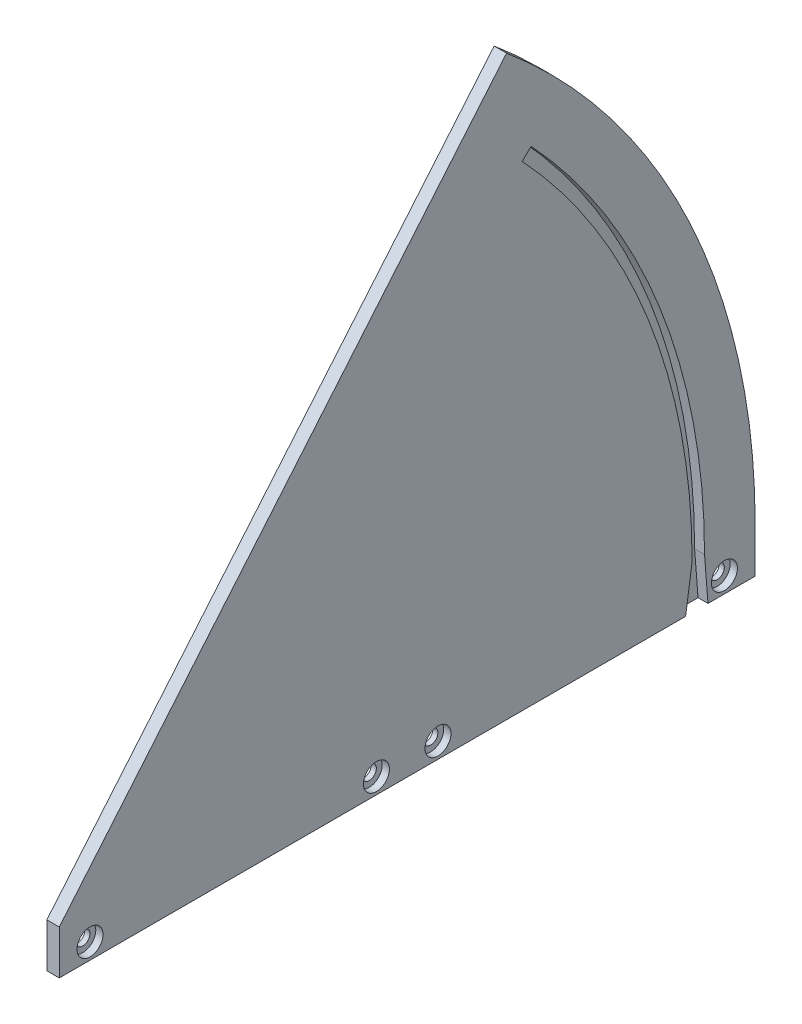
ISO-10303-21;
HEADER;
FILE_DESCRIPTION(('STEP AP214'),'2;1');
FILE_NAME('part.step','',(''),(''),'','','');
FILE_SCHEMA(('AUTOMOTIVE_DESIGN { 1 0 10303 214 1 1 1 1 }'));
ENDSEC;
DATA;
#1=APPLICATION_CONTEXT('core data for automotive mechanical design processes');
#2=APPLICATION_PROTOCOL_DEFINITION('international standard','automotive_design',2000,#1);
#3=PRODUCT_CONTEXT('',#1,'mechanical');
#4=PRODUCT('Part','Part','',(#3));
#5=PRODUCT_RELATED_PRODUCT_CATEGORY('part','',(#4));
#6=PRODUCT_DEFINITION_FORMATION('','',#4);
#7=PRODUCT_DEFINITION_CONTEXT('part definition',#1,'design');
#8=PRODUCT_DEFINITION('design','',#6,#7);
#9=PRODUCT_DEFINITION_SHAPE('','',#8);
#10=(LENGTH_UNIT() NAMED_UNIT(*) SI_UNIT(.MILLI.,.METRE.));
#11=(NAMED_UNIT(*) PLANE_ANGLE_UNIT() SI_UNIT($,.RADIAN.));
#12=(NAMED_UNIT(*) SI_UNIT($,.STERADIAN.) SOLID_ANGLE_UNIT());
#13=UNCERTAINTY_MEASURE_WITH_UNIT(LENGTH_MEASURE(1.E-05),#10,'distance_accuracy_value','');
#14=(GEOMETRIC_REPRESENTATION_CONTEXT(3) GLOBAL_UNCERTAINTY_ASSIGNED_CONTEXT((#13)) GLOBAL_UNIT_ASSIGNED_CONTEXT((#10,
#11,#12)) REPRESENTATION_CONTEXT('',''));
#15=CARTESIAN_POINT('',(0.,0.,0.));
#16=DIRECTION('',(0.,0.,1.));
#17=DIRECTION('',(1.,0.,0.));
#18=AXIS2_PLACEMENT_3D('',#15,#16,#17);
#19=CARTESIAN_POINT('',(0.,-7.239,-170.18));
#20=DIRECTION('',(1.,0.,0.));
#21=DIRECTION('',(0.,0.,-1.));
#22=AXIS2_PLACEMENT_3D('',#19,#20,#21);
#23=CYLINDRICAL_SURFACE('',#22,1.82880000000001);
#24=CARTESIAN_POINT('',(0.,-7.239,-170.18));
#25=DIRECTION('',(1.,0.,0.));
#26=DIRECTION('',(0.,0.,1.));
#27=AXIS2_PLACEMENT_3D('',#24,#25,#26);
#28=CIRCLE('',#27,1.82880000000001);
#29=CARTESIAN_POINT('',(0.,-7.239,-168.3512));
#30=VERTEX_POINT('',#29);
#31=EDGE_CURVE('E147',#30,#30,#28,.T.);
#32=ORIENTED_EDGE('',*,*,#31,.F.);
#33=EDGE_LOOP('',(#32));
#34=FACE_BOUND('',#33,.T.);
#35=CARTESIAN_POINT('',(1.3208,-7.239,-170.18));
#36=DIRECTION('',(1.,0.,0.));
#37=DIRECTION('',(0.,0.,-1.));
#38=AXIS2_PLACEMENT_3D('',#35,#36,#37);
#39=CIRCLE('',#38,1.82880000000001);
#40=CARTESIAN_POINT('',(1.3208,-7.239,-172.0088));
#41=VERTEX_POINT('',#40);
#42=EDGE_CURVE('E37',#41,#41,#39,.F.);
#43=ORIENTED_EDGE('',*,*,#42,.F.);
#44=EDGE_LOOP('',(#43));
#45=FACE_BOUND('',#44,.T.);
#46=ADVANCED_FACE('F33',(#34,#45),#23,.F.);
#47=CARTESIAN_POINT('',(0.,-7.23899999999998,-96.901));
#48=DIRECTION('',(1.,0.,0.));
#49=DIRECTION('',(0.,0.,-1.));
#50=AXIS2_PLACEMENT_3D('',#47,#48,#49);
#51=CYLINDRICAL_SURFACE('',#50,1.8288);
#52=CARTESIAN_POINT('',(0.,-7.23899999999998,-96.901));
#53=DIRECTION('',(1.,0.,0.));
#54=DIRECTION('',(0.,0.,1.));
#55=AXIS2_PLACEMENT_3D('',#52,#53,#54);
#56=CIRCLE('',#55,1.8288);
#57=CARTESIAN_POINT('',(0.,-7.23899999999998,-95.0722));
#58=VERTEX_POINT('',#57);
#59=EDGE_CURVE('E151',#58,#58,#56,.T.);
#60=ORIENTED_EDGE('',*,*,#59,.F.);
#61=EDGE_LOOP('',(#60));
#62=FACE_BOUND('',#61,.T.);
#63=CARTESIAN_POINT('',(1.3208,-7.23899999999998,-96.901));
#64=DIRECTION('',(1.,0.,0.));
#65=DIRECTION('',(0.,0.,-1.));
#66=AXIS2_PLACEMENT_3D('',#63,#64,#65);
#67=CIRCLE('',#66,1.8288);
#68=CARTESIAN_POINT('',(1.3208,-7.23899999999998,-98.7298));
#69=VERTEX_POINT('',#68);
#70=EDGE_CURVE('E204',#69,#69,#67,.F.);
#71=ORIENTED_EDGE('',*,*,#70,.F.);
#72=EDGE_LOOP('',(#71));
#73=FACE_BOUND('',#72,.T.);
#74=ADVANCED_FACE('F292',(#62,#73),#51,.F.);
#75=CARTESIAN_POINT('',(0.,-7.23899999999998,-81.153));
#76=DIRECTION('',(1.,0.,0.));
#77=DIRECTION('',(0.,0.,-1.));
#78=AXIS2_PLACEMENT_3D('',#75,#76,#77);
#79=CYLINDRICAL_SURFACE('',#78,1.8288);
#80=CARTESIAN_POINT('',(0.,-7.23899999999998,-81.153));
#81=DIRECTION('',(1.,0.,0.));
#82=DIRECTION('',(0.,0.,-1.));
#83=AXIS2_PLACEMENT_3D('',#80,#81,#82);
#84=CIRCLE('',#83,1.8288);
#85=CARTESIAN_POINT('',(0.,-7.23899999999998,-82.9818));
#86=VERTEX_POINT('',#85);
#87=EDGE_CURVE('E159',#86,#86,#84,.T.);
#88=ORIENTED_EDGE('',*,*,#87,.F.);
#89=EDGE_LOOP('',(#88));
#90=FACE_BOUND('',#89,.T.);
#91=CARTESIAN_POINT('',(1.3208,-7.23899999999998,-81.153));
#92=DIRECTION('',(1.,0.,0.));
#93=DIRECTION('',(0.,0.,-1.));
#94=AXIS2_PLACEMENT_3D('',#91,#92,#93);
#95=CIRCLE('',#94,1.8288);
#96=CARTESIAN_POINT('',(1.3208,-7.23899999999998,-82.9818));
#97=VERTEX_POINT('',#96);
#98=EDGE_CURVE('E200',#97,#97,#95,.F.);
#99=ORIENTED_EDGE('',*,*,#98,.F.);
#100=EDGE_LOOP('',(#99));
#101=FACE_BOUND('',#100,.T.);
#102=ADVANCED_FACE('F298',(#90,#101),#79,.F.);
#103=CARTESIAN_POINT('',(0.,-7.239,-7.874));
#104=DIRECTION('',(1.,0.,0.));
#105=DIRECTION('',(0.,0.,-1.));
#106=AXIS2_PLACEMENT_3D('',#103,#104,#105);
#107=CYLINDRICAL_SURFACE('',#106,1.8288);
#108=CARTESIAN_POINT('',(0.,-7.239,-7.874));
#109=DIRECTION('',(1.,0.,0.));
#110=DIRECTION('',(0.,0.,-1.));
#111=AXIS2_PLACEMENT_3D('',#108,#109,#110);
#112=CIRCLE('',#111,1.8288);
#113=CARTESIAN_POINT('',(0.,-7.239,-9.7028));
#114=VERTEX_POINT('',#113);
#115=EDGE_CURVE('E162',#114,#114,#112,.T.);
#116=ORIENTED_EDGE('',*,*,#115,.F.);
#117=EDGE_LOOP('',(#116));
#118=FACE_BOUND('',#117,.T.);
#119=CARTESIAN_POINT('',(1.3208,-7.239,-7.874));
#120=DIRECTION('',(1.,0.,0.));
#121=DIRECTION('',(0.,0.,-1.));
#122=AXIS2_PLACEMENT_3D('',#119,#120,#121);
#123=CIRCLE('',#122,1.8288);
#124=CARTESIAN_POINT('',(1.3208,-7.239,-9.7028));
#125=VERTEX_POINT('',#124);
#126=EDGE_CURVE('E195',#125,#125,#123,.F.);
#127=ORIENTED_EDGE('',*,*,#126,.F.);
#128=EDGE_LOOP('',(#127));
#129=FACE_BOUND('',#128,.T.);
#130=ADVANCED_FACE('F307',(#118,#129),#107,.F.);
#131=CARTESIAN_POINT('',(3.175,0.,0.));
#132=DIRECTION('',(1.,0.,0.));
#133=DIRECTION('',(0.,0.,-1.));
#134=AXIS2_PLACEMENT_3D('',#131,#132,#133);
#135=PLANE('',#134);
#136=CARTESIAN_POINT('',(3.175,-7.239,-170.18));
#137=DIRECTION('',(1.,0.,0.));
#138=DIRECTION('',(0.,0.,-1.));
#139=AXIS2_PLACEMENT_3D('',#136,#137,#138);
#140=CIRCLE('',#139,3.32740000000002);
#141=CARTESIAN_POINT('',(3.175,-7.239,-173.5074));
#142=VERTEX_POINT('',#141);
#143=EDGE_CURVE('E220',#142,#142,#140,.T.);
#144=ORIENTED_EDGE('',*,*,#143,.F.);
#145=EDGE_LOOP('',(#144));
#146=FACE_BOUND('',#145,.T.);
#147=CARTESIAN_POINT('',(3.175,-7.23899999999998,-96.901));
#148=DIRECTION('',(1.,0.,0.));
#149=DIRECTION('',(0.,0.,-1.));
#150=AXIS2_PLACEMENT_3D('',#147,#148,#149);
#151=CIRCLE('',#150,3.3274);
#152=CARTESIAN_POINT('',(3.175,-7.23899999999998,-100.2284));
#153=VERTEX_POINT('',#152);
#154=EDGE_CURVE('E213',#153,#153,#151,.T.);
#155=ORIENTED_EDGE('',*,*,#154,.F.);
#156=EDGE_LOOP('',(#155));
#157=FACE_BOUND('',#156,.T.);
#158=CARTESIAN_POINT('',(3.175,-7.23899999999998,-81.153));
#159=DIRECTION('',(1.,0.,0.));
#160=DIRECTION('',(0.,0.,-1.));
#161=AXIS2_PLACEMENT_3D('',#158,#159,#160);
#162=CIRCLE('',#161,3.3274);
#163=CARTESIAN_POINT('',(3.175,-7.23899999999998,-84.4804));
#164=VERTEX_POINT('',#163);
#165=EDGE_CURVE('E206',#164,#164,#162,.T.);
#166=ORIENTED_EDGE('',*,*,#165,.F.);
#167=EDGE_LOOP('',(#166));
#168=FACE_BOUND('',#167,.T.);
#169=CARTESIAN_POINT('',(3.175,-7.239,-7.874));
#170=DIRECTION('',(1.,0.,0.));
#171=DIRECTION('',(0.,0.,-1.));
#172=AXIS2_PLACEMENT_3D('',#169,#170,#171);
#173=CIRCLE('',#172,3.3274);
#174=CARTESIAN_POINT('',(3.175,-7.239,-11.2014));
#175=VERTEX_POINT('',#174);
#176=EDGE_CURVE('E202',#175,#175,#173,.T.);
#177=ORIENTED_EDGE('',*,*,#176,.F.);
#178=EDGE_LOOP('',(#177));
#179=FACE_BOUND('',#178,.T.);
#180=DIRECTION('',(0.,0.,1.));
#181=VECTOR('',#180,1.);
#182=CARTESIAN_POINT('',(3.175,-11.303,-178.054));
#183=LINE('',#182,#181);
#184=CARTESIAN_POINT('',(3.175,-11.303,-160.260021407787));
#185=VERTEX_POINT('',#184);
#186=CARTESIAN_POINT('',(3.175,-11.303,0.));
#187=VERTEX_POINT('',#186);
#188=EDGE_CURVE('E170',#185,#187,#183,.T.);
#189=ORIENTED_EDGE('',*,*,#188,.F.);
#190=DIRECTION('',(0.,0.989324172843865,-0.145731537516086));
#191=VECTOR('',#190,1.);
#192=CARTESIAN_POINT('',(3.175,-11.303,-160.260021407787));
#193=LINE('',#192,#191);
#194=CARTESIAN_POINT('',(3.175,0.,-161.925));
#195=VERTEX_POINT('',#194);
#196=EDGE_CURVE('E198',#185,#195,#193,.T.);
#197=ORIENTED_EDGE('',*,*,#196,.T.);
#198=CARTESIAN_POINT('',(3.175,0.,0.));
#199=DIRECTION('',(1.,0.,0.));
#200=DIRECTION('',(0.,0.,-1.));
#201=AXIS2_PLACEMENT_3D('',#198,#199,#200);
#202=CIRCLE('',#201,161.925);
#203=CARTESIAN_POINT('',(3.175,110.43258445312,-118.424448134684));
#204=VERTEX_POINT('',#203);
#205=EDGE_CURVE('E146',#195,#204,#202,.T.);
#206=ORIENTED_EDGE('',*,*,#205,.T.);
#207=DIRECTION('',(0.,-0.681998360062499,0.73135370161917));
#208=VECTOR('',#207,1.);
#209=CARTESIAN_POINT('',(3.175,112.597929246319,-120.746496137325));
#210=LINE('',#209,#208);
#211=CARTESIAN_POINT('',(3.175,112.597929246319,-120.746496137325));
#212=VERTEX_POINT('',#211);
#213=EDGE_CURVE('E238',#212,#204,#210,.T.);
#214=ORIENTED_EDGE('',*,*,#213,.F.);
#215=CARTESIAN_POINT('',(3.175,0.,0.));
#216=DIRECTION('',(1.,0.,0.));
#217=DIRECTION('',(0.,0.,-1.));
#218=AXIS2_PLACEMENT_3D('',#215,#216,#217);
#219=CIRCLE('',#218,165.1);
#220=CARTESIAN_POINT('',(3.175,0.,-165.1));
#221=VERTEX_POINT('',#220);
#222=EDGE_CURVE('E241',#221,#212,#219,.T.);
#223=ORIENTED_EDGE('',*,*,#222,.F.);
#224=DIRECTION('',(0.,-0.996964960372701,-0.077851575379422));
#225=VECTOR('',#224,1.);
#226=CARTESIAN_POINT('',(3.175,0.,-165.1));
#227=LINE('',#226,#225);
#228=CARTESIAN_POINT('',(3.175,-11.303,-165.98263518929));
#229=VERTEX_POINT('',#228);
#230=EDGE_CURVE('E142',#221,#229,#227,.T.);
#231=ORIENTED_EDGE('',*,*,#230,.T.);
#232=CARTESIAN_POINT('',(3.175,-11.303,-178.054));
#233=VERTEX_POINT('',#232);
#234=EDGE_CURVE('E171',#233,#229,#183,.T.);
#235=ORIENTED_EDGE('',*,*,#234,.F.);
#236=DIRECTION('',(0.,1.,0.));
#237=VECTOR('',#236,1.);
#238=CARTESIAN_POINT('',(3.175,-11.303,-178.054));
#239=LINE('',#238,#237);
#240=CARTESIAN_POINT('',(3.175,0.,-178.054));
#241=VERTEX_POINT('',#240);
#242=EDGE_CURVE('E182',#233,#241,#239,.T.);
#243=ORIENTED_EDGE('',*,*,#242,.T.);
#244=CARTESIAN_POINT('',(3.175,0.,0.));
#245=DIRECTION('',(1.,0.,0.));
#246=DIRECTION('',(0.,0.,-1.));
#247=AXIS2_PLACEMENT_3D('',#244,#245,#246);
#248=CIRCLE('',#247,178.054);
#249=CARTESIAN_POINT('',(3.175,136.397277275107,-114.450905055127));
#250=VERTEX_POINT('',#249);
#251=EDGE_CURVE('E59',#241,#250,#248,.T.);
#252=ORIENTED_EDGE('',*,*,#251,.T.);
#253=DIRECTION('',(0.,-0.766044443118979,0.642787609686538));
#254=VECTOR('',#253,1.);
#255=CARTESIAN_POINT('',(3.175,0.,0.));
#256=LINE('',#255,#254);
#257=CARTESIAN_POINT('',(3.175,0.,0.));
#258=VERTEX_POINT('',#257);
#259=EDGE_CURVE('E76',#250,#258,#256,.T.);
#260=ORIENTED_EDGE('',*,*,#259,.T.);
#261=DIRECTION('',(0.,1.,0.));
#262=VECTOR('',#261,1.);
#263=CARTESIAN_POINT('',(3.175,-11.303,0.));
#264=LINE('',#263,#262);
#265=EDGE_CURVE('E179',#187,#258,#264,.T.);
#266=ORIENTED_EDGE('',*,*,#265,.F.);
#267=EDGE_LOOP('',(#189,#197,#206,#214,#223,#231,#235,#243,#252,#260,#266));
#268=FACE_BOUND('',#267,.T.);
#269=ADVANCED_FACE('F259',(#146,#157,#168,#179,#268),#135,.T.);
#270=CARTESIAN_POINT('',(0.,-11.303,0.));
#271=DIRECTION('',(0.,1.,0.));
#272=DIRECTION('',(0.,0.,1.));
#273=AXIS2_PLACEMENT_3D('',#270,#271,#272);
#274=PLANE('',#273);
#275=DIRECTION('',(1.,0.,0.));
#276=VECTOR('',#275,1.);
#277=CARTESIAN_POINT('',(0.635,-11.303,-160.260021407787));
#278=LINE('',#277,#276);
#279=CARTESIAN_POINT('',(0.635,-11.303,-160.260021407787));
#280=VERTEX_POINT('',#279);
#281=EDGE_CURVE('E140',#280,#185,#278,.T.);
#282=ORIENTED_EDGE('',*,*,#281,.T.);
#283=ORIENTED_EDGE('',*,*,#188,.T.);
#284=DIRECTION('',(-1.,0.,0.));
#285=VECTOR('',#284,1.);
#286=CARTESIAN_POINT('',(0.,-11.303,0.));
#287=LINE('',#286,#285);
#288=CARTESIAN_POINT('',(0.,-11.303,0.));
#289=VERTEX_POINT('',#288);
#290=EDGE_CURVE('E174',#187,#289,#287,.T.);
#291=ORIENTED_EDGE('',*,*,#290,.T.);
#292=DIRECTION('',(0.,0.,-1.));
#293=VECTOR('',#292,1.);
#294=CARTESIAN_POINT('',(0.,-11.303,-178.054));
#295=LINE('',#294,#293);
#296=CARTESIAN_POINT('',(0.,-11.303,-178.054));
#297=VERTEX_POINT('',#296);
#298=EDGE_CURVE('E165',#289,#297,#295,.T.);
#299=ORIENTED_EDGE('',*,*,#298,.T.);
#300=DIRECTION('',(1.,0.,0.));
#301=VECTOR('',#300,1.);
#302=CARTESIAN_POINT('',(0.,-11.303,-178.054));
#303=LINE('',#302,#301);
#304=EDGE_CURVE('E168',#297,#233,#303,.T.);
#305=ORIENTED_EDGE('',*,*,#304,.T.);
#306=ORIENTED_EDGE('',*,*,#234,.T.);
#307=DIRECTION('',(1.,0.,0.));
#308=VECTOR('',#307,1.);
#309=CARTESIAN_POINT('',(0.635,-11.303,-165.98263518929));
#310=LINE('',#309,#308);
#311=CARTESIAN_POINT('',(0.635,-11.303,-165.98263518929));
#312=VERTEX_POINT('',#311);
#313=EDGE_CURVE('E247',#312,#229,#310,.T.);
#314=ORIENTED_EDGE('',*,*,#313,.F.);
#315=DIRECTION('',(0.,0.,1.));
#316=VECTOR('',#315,1.);
#317=CARTESIAN_POINT('',(0.635,-11.303,-165.98263518929));
#318=LINE('',#317,#316);
#319=EDGE_CURVE('E234',#312,#280,#318,.T.);
#320=ORIENTED_EDGE('',*,*,#319,.T.);
#321=EDGE_LOOP('',(#282,#283,#291,#299,#305,#306,#314,#320));
#322=FACE_BOUND('',#321,.T.);
#323=ADVANCED_FACE('F261',(#322),#274,.F.);
#324=CARTESIAN_POINT('',(3.175,0.,0.));
#325=DIRECTION('',(0.,-0.642787609686538,-0.766044443118979));
#326=DIRECTION('',(0.,0.766044443118979,-0.642787609686538));
#327=AXIS2_PLACEMENT_3D('',#324,#325,#326);
#328=PLANE('',#327);
#329=DIRECTION('',(0.,-0.766044443118979,0.642787609686538));
#330=VECTOR('',#329,1.);
#331=CARTESIAN_POINT('',(0.,0.,0.));
#332=LINE('',#331,#330);
#333=CARTESIAN_POINT('',(0.,136.397277275107,-114.450905055127));
#334=VERTEX_POINT('',#333);
#335=CARTESIAN_POINT('',(0.,0.,0.));
#336=VERTEX_POINT('',#335);
#337=EDGE_CURVE('E187',#334,#336,#332,.T.);
#338=ORIENTED_EDGE('',*,*,#337,.T.);
#339=DIRECTION('',(-1.,0.,0.));
#340=VECTOR('',#339,1.);
#341=CARTESIAN_POINT('',(3.175,0.,0.));
#342=LINE('',#341,#340);
#343=EDGE_CURVE('E11',#258,#336,#342,.T.);
#344=ORIENTED_EDGE('',*,*,#343,.F.);
#345=ORIENTED_EDGE('',*,*,#259,.F.);
#346=DIRECTION('',(-1.,0.,0.));
#347=VECTOR('',#346,1.);
#348=CARTESIAN_POINT('',(3.175,136.397277275107,-114.450905055127));
#349=LINE('',#348,#347);
#350=EDGE_CURVE('E190',#250,#334,#349,.T.);
#351=ORIENTED_EDGE('',*,*,#350,.T.);
#352=EDGE_LOOP('',(#338,#344,#345,#351));
#353=FACE_BOUND('',#352,.T.);
#354=ADVANCED_FACE('F35',(#353),#328,.F.);
#355=CARTESIAN_POINT('',(3.175,0.,0.));
#356=DIRECTION('',(-1.,0.,0.));
#357=DIRECTION('',(0.,0.,1.));
#358=AXIS2_PLACEMENT_3D('',#355,#356,#357);
#359=CYLINDRICAL_SURFACE('',#358,178.054);
#360=CARTESIAN_POINT('',(0.,0.,0.));
#361=DIRECTION('',(1.,0.,0.));
#362=DIRECTION('',(0.,0.,-1.));
#363=AXIS2_PLACEMENT_3D('',#360,#361,#362);
#364=CIRCLE('',#363,178.054);
#365=CARTESIAN_POINT('',(0.,0.,-178.054));
#366=VERTEX_POINT('',#365);
#367=EDGE_CURVE('E72',#366,#334,#364,.T.);
#368=ORIENTED_EDGE('',*,*,#367,.T.);
#369=ORIENTED_EDGE('',*,*,#350,.F.);
#370=ORIENTED_EDGE('',*,*,#251,.F.);
#371=DIRECTION('',(-1.,0.,0.));
#372=VECTOR('',#371,1.);
#373=CARTESIAN_POINT('',(3.175,0.,-178.054));
#374=LINE('',#373,#372);
#375=EDGE_CURVE('E42',#241,#366,#374,.T.);
#376=ORIENTED_EDGE('',*,*,#375,.T.);
#377=EDGE_LOOP('',(#368,#369,#370,#376));
#378=FACE_BOUND('',#377,.T.);
#379=ADVANCED_FACE('F273',(#378),#359,.T.);
#380=CARTESIAN_POINT('',(0.,0.,0.));
#381=DIRECTION('',(1.,0.,0.));
#382=DIRECTION('',(0.,0.,-1.));
#383=AXIS2_PLACEMENT_3D('',#380,#381,#382);
#384=PLANE('',#383);
#385=ORIENTED_EDGE('',*,*,#31,.T.);
#386=EDGE_LOOP('',(#385));
#387=FACE_BOUND('',#386,.T.);
#388=ORIENTED_EDGE('',*,*,#59,.T.);
#389=EDGE_LOOP('',(#388));
#390=FACE_BOUND('',#389,.T.);
#391=ORIENTED_EDGE('',*,*,#87,.T.);
#392=EDGE_LOOP('',(#391));
#393=FACE_BOUND('',#392,.T.);
#394=ORIENTED_EDGE('',*,*,#115,.T.);
#395=EDGE_LOOP('',(#394));
#396=FACE_BOUND('',#395,.T.);
#397=ORIENTED_EDGE('',*,*,#337,.F.);
#398=ORIENTED_EDGE('',*,*,#367,.F.);
#399=DIRECTION('',(0.,1.,0.));
#400=VECTOR('',#399,1.);
#401=CARTESIAN_POINT('',(0.,-11.303,-178.054));
#402=LINE('',#401,#400);
#403=EDGE_CURVE('E184',#297,#366,#402,.T.);
#404=ORIENTED_EDGE('',*,*,#403,.F.);
#405=ORIENTED_EDGE('',*,*,#298,.F.);
#406=DIRECTION('',(0.,1.,0.));
#407=VECTOR('',#406,1.);
#408=CARTESIAN_POINT('',(0.,-11.303,0.));
#409=LINE('',#408,#407);
#410=EDGE_CURVE('E176',#289,#336,#409,.T.);
#411=ORIENTED_EDGE('',*,*,#410,.T.);
#412=EDGE_LOOP('',(#397,#398,#404,#405,#411));
#413=FACE_BOUND('',#412,.T.);
#414=ADVANCED_FACE('F276',(#387,#390,#393,#396,#413),#384,.F.);
#415=CARTESIAN_POINT('',(0.,-11.303,-178.054));
#416=DIRECTION('',(0.,0.,1.));
#417=DIRECTION('',(1.,0.,0.));
#418=AXIS2_PLACEMENT_3D('',#415,#416,#417);
#419=PLANE('',#418);
#420=ORIENTED_EDGE('',*,*,#375,.F.);
#421=ORIENTED_EDGE('',*,*,#242,.F.);
#422=ORIENTED_EDGE('',*,*,#304,.F.);
#423=ORIENTED_EDGE('',*,*,#403,.T.);
#424=EDGE_LOOP('',(#420,#421,#422,#423));
#425=FACE_BOUND('',#424,.T.);
#426=ADVANCED_FACE('F272',(#425),#419,.F.);
#427=CARTESIAN_POINT('',(0.,-11.303,0.));
#428=DIRECTION('',(0.,0.,-1.));
#429=DIRECTION('',(-1.,0.,0.));
#430=AXIS2_PLACEMENT_3D('',#427,#428,#429);
#431=PLANE('',#430);
#432=ORIENTED_EDGE('',*,*,#343,.T.);
#433=ORIENTED_EDGE('',*,*,#410,.F.);
#434=ORIENTED_EDGE('',*,*,#290,.F.);
#435=ORIENTED_EDGE('',*,*,#265,.T.);
#436=EDGE_LOOP('',(#432,#433,#434,#435));
#437=FACE_BOUND('',#436,.T.);
#438=ADVANCED_FACE('F280',(#437),#431,.F.);
#439=CARTESIAN_POINT('',(0.635,-11.303,-160.260021407787));
#440=DIRECTION('',(0.,-0.145731537516086,-0.989324172843865));
#441=DIRECTION('',(0.,0.989324172843865,-0.145731537516086));
#442=AXIS2_PLACEMENT_3D('',#439,#440,#441);
#443=PLANE('',#442);
#444=ORIENTED_EDGE('',*,*,#196,.F.);
#445=ORIENTED_EDGE('',*,*,#281,.F.);
#446=DIRECTION('',(0.,0.989324172843865,-0.145731537516086));
#447=VECTOR('',#446,1.);
#448=CARTESIAN_POINT('',(0.635,-11.303,-160.260021407787));
#449=LINE('',#448,#447);
#450=CARTESIAN_POINT('',(0.635,0.,-161.925));
#451=VERTEX_POINT('',#450);
#452=EDGE_CURVE('E50',#280,#451,#449,.T.);
#453=ORIENTED_EDGE('',*,*,#452,.T.);
#454=DIRECTION('',(1.,0.,0.));
#455=VECTOR('',#454,1.);
#456=CARTESIAN_POINT('',(0.635,0.,-161.925));
#457=LINE('',#456,#455);
#458=EDGE_CURVE('E137',#451,#195,#457,.T.);
#459=ORIENTED_EDGE('',*,*,#458,.T.);
#460=EDGE_LOOP('',(#444,#445,#453,#459));
#461=FACE_BOUND('',#460,.T.);
#462=ADVANCED_FACE('F136',(#461),#443,.T.);
#463=CARTESIAN_POINT('',(0.635,0.,0.));
#464=DIRECTION('',(1.,0.,0.));
#465=DIRECTION('',(0.,0.,-1.));
#466=AXIS2_PLACEMENT_3D('',#463,#464,#465);
#467=CYLINDRICAL_SURFACE('',#466,161.925);
#468=ORIENTED_EDGE('',*,*,#205,.F.);
#469=ORIENTED_EDGE('',*,*,#458,.F.);
#470=CARTESIAN_POINT('',(0.635,0.,0.));
#471=DIRECTION('',(1.,0.,0.));
#472=DIRECTION('',(0.,0.,-1.));
#473=AXIS2_PLACEMENT_3D('',#470,#471,#472);
#474=CIRCLE('',#473,161.925);
#475=CARTESIAN_POINT('',(0.635,110.43258445312,-118.424448134684));
#476=VERTEX_POINT('',#475);
#477=EDGE_CURVE('E125',#451,#476,#474,.T.);
#478=ORIENTED_EDGE('',*,*,#477,.T.);
#479=DIRECTION('',(1.,0.,0.));
#480=VECTOR('',#479,1.);
#481=CARTESIAN_POINT('',(0.635,110.43258445312,-118.424448134684));
#482=LINE('',#481,#480);
#483=EDGE_CURVE('E148',#476,#204,#482,.T.);
#484=ORIENTED_EDGE('',*,*,#483,.T.);
#485=EDGE_LOOP('',(#468,#469,#478,#484));
#486=FACE_BOUND('',#485,.T.);
#487=ADVANCED_FACE('F144',(#486),#467,.T.);
#488=CARTESIAN_POINT('',(0.635,112.597929246319,-120.746496137325));
#489=DIRECTION('',(0.,0.73135370161917,0.681998360062499));
#490=DIRECTION('',(0.,-0.681998360062499,0.73135370161917));
#491=AXIS2_PLACEMENT_3D('',#488,#489,#490);
#492=PLANE('',#491);
#493=ORIENTED_EDGE('',*,*,#213,.T.);
#494=ORIENTED_EDGE('',*,*,#483,.F.);
#495=DIRECTION('',(0.,-0.681998360062499,0.73135370161917));
#496=VECTOR('',#495,1.);
#497=CARTESIAN_POINT('',(0.635,112.597929246319,-120.746496137325));
#498=LINE('',#497,#496);
#499=CARTESIAN_POINT('',(0.635,112.597929246319,-120.746496137325));
#500=VERTEX_POINT('',#499);
#501=EDGE_CURVE('E129',#500,#476,#498,.T.);
#502=ORIENTED_EDGE('',*,*,#501,.F.);
#503=DIRECTION('',(1.,0.,0.));
#504=VECTOR('',#503,1.);
#505=CARTESIAN_POINT('',(0.635,112.597929246319,-120.746496137325));
#506=LINE('',#505,#504);
#507=EDGE_CURVE('E153',#500,#212,#506,.T.);
#508=ORIENTED_EDGE('',*,*,#507,.T.);
#509=EDGE_LOOP('',(#493,#494,#502,#508));
#510=FACE_BOUND('',#509,.T.);
#511=ADVANCED_FACE('F251',(#510),#492,.F.);
#512=CARTESIAN_POINT('',(0.635,0.,0.));
#513=DIRECTION('',(1.,0.,0.));
#514=DIRECTION('',(0.,0.,-1.));
#515=AXIS2_PLACEMENT_3D('',#512,#513,#514);
#516=CYLINDRICAL_SURFACE('',#515,165.1);
#517=ORIENTED_EDGE('',*,*,#222,.T.);
#518=ORIENTED_EDGE('',*,*,#507,.F.);
#519=CARTESIAN_POINT('',(0.635,0.,0.));
#520=DIRECTION('',(1.,0.,0.));
#521=DIRECTION('',(0.,0.,-1.));
#522=AXIS2_PLACEMENT_3D('',#519,#520,#521);
#523=CIRCLE('',#522,165.1);
#524=CARTESIAN_POINT('',(0.635,0.,-165.1));
#525=VERTEX_POINT('',#524);
#526=EDGE_CURVE('E230',#525,#500,#523,.T.);
#527=ORIENTED_EDGE('',*,*,#526,.F.);
#528=DIRECTION('',(1.,0.,0.));
#529=VECTOR('',#528,1.);
#530=CARTESIAN_POINT('',(0.635,0.,-165.1));
#531=LINE('',#530,#529);
#532=EDGE_CURVE('E249',#525,#221,#531,.T.);
#533=ORIENTED_EDGE('',*,*,#532,.T.);
#534=EDGE_LOOP('',(#517,#518,#527,#533));
#535=FACE_BOUND('',#534,.T.);
#536=ADVANCED_FACE('F256',(#535),#516,.F.);
#537=CARTESIAN_POINT('',(0.635,0.,-165.1));
#538=DIRECTION('',(0.,-0.077851575379422,0.996964960372701));
#539=DIRECTION('',(0.,-0.996964960372702,-0.077851575379422));
#540=AXIS2_PLACEMENT_3D('',#537,#538,#539);
#541=PLANE('',#540);
#542=ORIENTED_EDGE('',*,*,#230,.F.);
#543=ORIENTED_EDGE('',*,*,#532,.F.);
#544=DIRECTION('',(0.,-0.996964960372701,-0.077851575379422));
#545=VECTOR('',#544,1.);
#546=CARTESIAN_POINT('',(0.635,0.,-165.1));
#547=LINE('',#546,#545);
#548=EDGE_CURVE('E232',#525,#312,#547,.T.);
#549=ORIENTED_EDGE('',*,*,#548,.T.);
#550=ORIENTED_EDGE('',*,*,#313,.T.);
#551=EDGE_LOOP('',(#542,#543,#549,#550));
#552=FACE_BOUND('',#551,.T.);
#553=ADVANCED_FACE('F265',(#552),#541,.T.);
#554=CARTESIAN_POINT('',(0.635,0.,0.));
#555=DIRECTION('',(1.,0.,0.));
#556=DIRECTION('',(0.,0.,-1.));
#557=AXIS2_PLACEMENT_3D('',#554,#555,#556);
#558=PLANE('',#557);
#559=ORIENTED_EDGE('',*,*,#452,.F.);
#560=ORIENTED_EDGE('',*,*,#319,.F.);
#561=ORIENTED_EDGE('',*,*,#548,.F.);
#562=ORIENTED_EDGE('',*,*,#526,.T.);
#563=ORIENTED_EDGE('',*,*,#501,.T.);
#564=ORIENTED_EDGE('',*,*,#477,.F.);
#565=EDGE_LOOP('',(#559,#560,#561,#562,#563,#564));
#566=FACE_BOUND('',#565,.T.);
#567=ADVANCED_FACE('F126',(#566),#558,.T.);
#568=CARTESIAN_POINT('',(1.3208,-7.239,-7.874));
#569=DIRECTION('',(1.,0.,0.));
#570=DIRECTION('',(0.,0.,-1.));
#571=AXIS2_PLACEMENT_3D('',#568,#569,#570);
#572=PLANE('',#571);
#573=CARTESIAN_POINT('',(1.3208,-7.239,-7.874));
#574=DIRECTION('',(1.,0.,0.));
#575=DIRECTION('',(0.,0.,-1.));
#576=AXIS2_PLACEMENT_3D('',#573,#574,#575);
#577=CIRCLE('',#576,3.3274);
#578=CARTESIAN_POINT('',(1.3208,-7.239,-11.2014));
#579=VERTEX_POINT('',#578);
#580=EDGE_CURVE('E199',#579,#579,#577,.T.);
#581=ORIENTED_EDGE('',*,*,#580,.T.);
#582=EDGE_LOOP('',(#581));
#583=FACE_BOUND('',#582,.T.);
#584=ORIENTED_EDGE('',*,*,#126,.T.);
#585=EDGE_LOOP('',(#584));
#586=FACE_BOUND('',#585,.T.);
#587=ADVANCED_FACE('F397',(#583,#586),#572,.T.);
#588=CARTESIAN_POINT('',(1.3208,-7.239,-7.874));
#589=DIRECTION('',(1.,0.,0.));
#590=DIRECTION('',(0.,0.,-1.));
#591=AXIS2_PLACEMENT_3D('',#588,#589,#590);
#592=CYLINDRICAL_SURFACE('',#591,3.3274);
#593=ORIENTED_EDGE('',*,*,#580,.F.);
#594=EDGE_LOOP('',(#593));
#595=FACE_BOUND('',#594,.T.);
#596=ORIENTED_EDGE('',*,*,#176,.T.);
#597=EDGE_LOOP('',(#596));
#598=FACE_BOUND('',#597,.T.);
#599=ADVANCED_FACE('F422',(#595,#598),#592,.F.);
#600=CARTESIAN_POINT('',(1.3208,-7.23899999999998,-81.153));
#601=DIRECTION('',(1.,0.,0.));
#602=DIRECTION('',(0.,0.,-1.));
#603=AXIS2_PLACEMENT_3D('',#600,#601,#602);
#604=PLANE('',#603);
#605=CARTESIAN_POINT('',(1.3208,-7.23899999999998,-81.153));
#606=DIRECTION('',(1.,0.,0.));
#607=DIRECTION('',(0.,0.,-1.));
#608=AXIS2_PLACEMENT_3D('',#605,#606,#607);
#609=CIRCLE('',#608,3.3274);
#610=CARTESIAN_POINT('',(1.3208,-7.23899999999998,-84.4804));
#611=VERTEX_POINT('',#610);
#612=EDGE_CURVE('E203',#611,#611,#609,.T.);
#613=ORIENTED_EDGE('',*,*,#612,.T.);
#614=EDGE_LOOP('',(#613));
#615=FACE_BOUND('',#614,.T.);
#616=ORIENTED_EDGE('',*,*,#98,.T.);
#617=EDGE_LOOP('',(#616));
#618=FACE_BOUND('',#617,.T.);
#619=ADVANCED_FACE('F431',(#615,#618),#604,.T.);
#620=CARTESIAN_POINT('',(1.3208,-7.23899999999998,-81.153));
#621=DIRECTION('',(1.,0.,0.));
#622=DIRECTION('',(0.,0.,-1.));
#623=AXIS2_PLACEMENT_3D('',#620,#621,#622);
#624=CYLINDRICAL_SURFACE('',#623,3.3274);
#625=ORIENTED_EDGE('',*,*,#612,.F.);
#626=EDGE_LOOP('',(#625));
#627=FACE_BOUND('',#626,.T.);
#628=ORIENTED_EDGE('',*,*,#165,.T.);
#629=EDGE_LOOP('',(#628));
#630=FACE_BOUND('',#629,.T.);
#631=ADVANCED_FACE('F440',(#627,#630),#624,.F.);
#632=CARTESIAN_POINT('',(1.3208,-7.23899999999998,-96.901));
#633=DIRECTION('',(1.,0.,0.));
#634=DIRECTION('',(0.,0.,-1.));
#635=AXIS2_PLACEMENT_3D('',#632,#633,#634);
#636=PLANE('',#635);
#637=CARTESIAN_POINT('',(1.3208,-7.23899999999998,-96.901));
#638=DIRECTION('',(1.,0.,0.));
#639=DIRECTION('',(0.,0.,-1.));
#640=AXIS2_PLACEMENT_3D('',#637,#638,#639);
#641=CIRCLE('',#640,3.3274);
#642=CARTESIAN_POINT('',(1.3208,-7.23899999999998,-100.2284));
#643=VERTEX_POINT('',#642);
#644=EDGE_CURVE('E207',#643,#643,#641,.T.);
#645=ORIENTED_EDGE('',*,*,#644,.T.);
#646=EDGE_LOOP('',(#645));
#647=FACE_BOUND('',#646,.T.);
#648=ORIENTED_EDGE('',*,*,#70,.T.);
#649=EDGE_LOOP('',(#648));
#650=FACE_BOUND('',#649,.T.);
#651=ADVANCED_FACE('F449',(#647,#650),#636,.T.);
#652=CARTESIAN_POINT('',(1.3208,-7.23899999999998,-96.901));
#653=DIRECTION('',(1.,0.,0.));
#654=DIRECTION('',(0.,0.,-1.));
#655=AXIS2_PLACEMENT_3D('',#652,#653,#654);
#656=CYLINDRICAL_SURFACE('',#655,3.3274);
#657=ORIENTED_EDGE('',*,*,#644,.F.);
#658=EDGE_LOOP('',(#657));
#659=FACE_BOUND('',#658,.T.);
#660=ORIENTED_EDGE('',*,*,#154,.T.);
#661=EDGE_LOOP('',(#660));
#662=FACE_BOUND('',#661,.T.);
#663=ADVANCED_FACE('F458',(#659,#662),#656,.F.);
#664=CARTESIAN_POINT('',(1.3208,-7.239,-170.18));
#665=DIRECTION('',(1.,0.,0.));
#666=DIRECTION('',(0.,0.,-1.));
#667=AXIS2_PLACEMENT_3D('',#664,#665,#666);
#668=PLANE('',#667);
#669=CARTESIAN_POINT('',(1.3208,-7.239,-170.18));
#670=DIRECTION('',(1.,0.,0.));
#671=DIRECTION('',(0.,0.,-1.));
#672=AXIS2_PLACEMENT_3D('',#669,#670,#671);
#673=CIRCLE('',#672,3.32740000000002);
#674=CARTESIAN_POINT('',(1.3208,-7.239,-173.5074));
#675=VERTEX_POINT('',#674);
#676=EDGE_CURVE('E503',#675,#675,#673,.T.);
#677=ORIENTED_EDGE('',*,*,#676,.T.);
#678=EDGE_LOOP('',(#677));
#679=FACE_BOUND('',#678,.T.);
#680=ORIENTED_EDGE('',*,*,#42,.T.);
#681=EDGE_LOOP('',(#680));
#682=FACE_BOUND('',#681,.T.);
#683=ADVANCED_FACE('F466',(#679,#682),#668,.T.);
#684=CARTESIAN_POINT('',(1.3208,-7.239,-170.18));
#685=DIRECTION('',(1.,0.,0.));
#686=DIRECTION('',(0.,0.,-1.));
#687=AXIS2_PLACEMENT_3D('',#684,#685,#686);
#688=CYLINDRICAL_SURFACE('',#687,3.32740000000002);
#689=ORIENTED_EDGE('',*,*,#676,.F.);
#690=EDGE_LOOP('',(#689));
#691=FACE_BOUND('',#690,.T.);
#692=ORIENTED_EDGE('',*,*,#143,.T.);
#693=EDGE_LOOP('',(#692));
#694=FACE_BOUND('',#693,.T.);
#695=ADVANCED_FACE('F475',(#691,#694),#688,.F.);
#696=CLOSED_SHELL('',(#46,#74,#102,#130,#269,#323,#354,#379,#414,#426,#438,#462,#487,#511,#536,
#553,#567,#587,#599,#619,#631,#651,#663,#683,#695));
#697=MANIFOLD_SOLID_BREP('B2',#696);
#698=ADVANCED_BREP_SHAPE_REPRESENTATION('',(#18,#697),#14);
#699=SHAPE_DEFINITION_REPRESENTATION(#9,#698);
ENDSEC;
END-ISO-10303-21;
